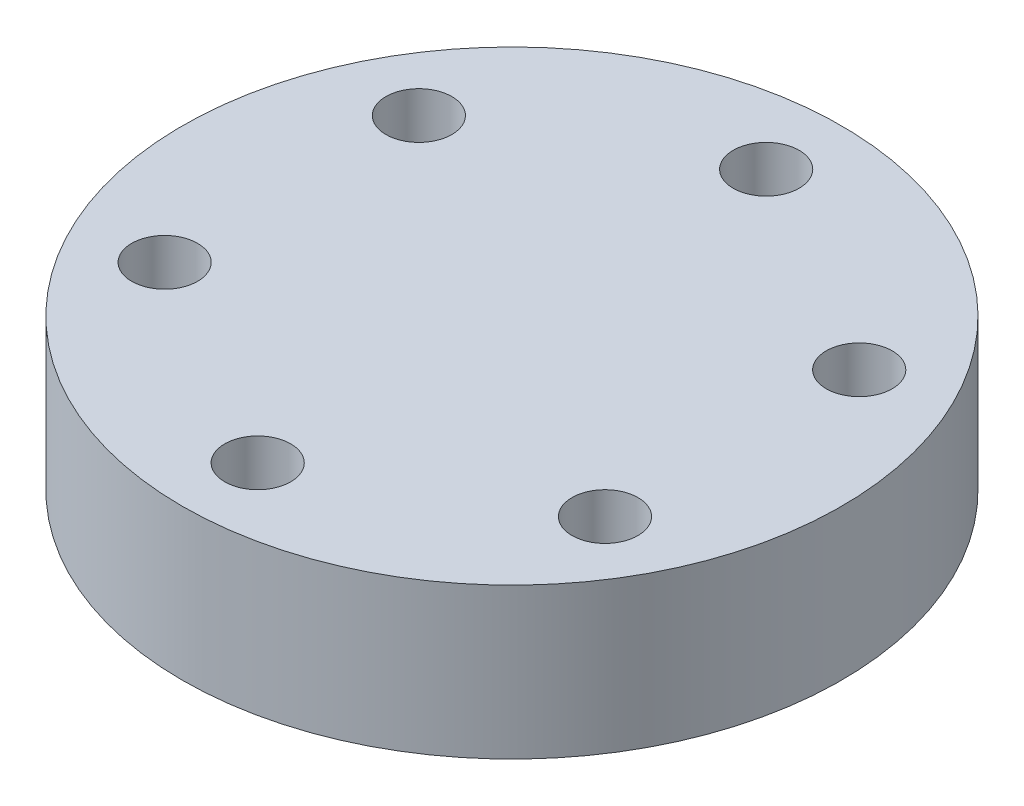
ISO-10303-21;
HEADER;
FILE_DESCRIPTION(('STEP AP214'),'2;1');
FILE_NAME('part.step','',(''),(''),'','','');
FILE_SCHEMA(('AUTOMOTIVE_DESIGN { 1 0 10303 214 1 1 1 1 }'));
ENDSEC;
DATA;
#1=APPLICATION_CONTEXT('core data for automotive mechanical design processes');
#2=APPLICATION_PROTOCOL_DEFINITION('international standard','automotive_design',2000,#1);
#3=PRODUCT_CONTEXT('',#1,'mechanical');
#4=PRODUCT('Part','Part','',(#3));
#5=PRODUCT_RELATED_PRODUCT_CATEGORY('part','',(#4));
#6=PRODUCT_DEFINITION_FORMATION('','',#4);
#7=PRODUCT_DEFINITION_CONTEXT('part definition',#1,'design');
#8=PRODUCT_DEFINITION('design','',#6,#7);
#9=PRODUCT_DEFINITION_SHAPE('','',#8);
#10=(LENGTH_UNIT() NAMED_UNIT(*) SI_UNIT(.MILLI.,.METRE.));
#11=(NAMED_UNIT(*) PLANE_ANGLE_UNIT() SI_UNIT($,.RADIAN.));
#12=(NAMED_UNIT(*) SI_UNIT($,.STERADIAN.) SOLID_ANGLE_UNIT());
#13=UNCERTAINTY_MEASURE_WITH_UNIT(LENGTH_MEASURE(1.E-05),#10,'distance_accuracy_value','');
#14=(GEOMETRIC_REPRESENTATION_CONTEXT(3) GLOBAL_UNCERTAINTY_ASSIGNED_CONTEXT((#13)) GLOBAL_UNIT_ASSIGNED_CONTEXT((#10,
#11,#12)) REPRESENTATION_CONTEXT('',''));
#15=CARTESIAN_POINT('',(0.,0.,0.));
#16=DIRECTION('',(0.,0.,1.));
#17=DIRECTION('',(1.,0.,0.));
#18=AXIS2_PLACEMENT_3D('',#15,#16,#17);
#19=CARTESIAN_POINT('',(0.,8.,0.));
#20=DIRECTION('',(0.,-1.,0.));
#21=DIRECTION('',(0.,0.,-1.));
#22=AXIS2_PLACEMENT_3D('',#19,#20,#21);
#23=CYLINDRICAL_SURFACE('',#22,17.5);
#24=CARTESIAN_POINT('',(0.,8.,0.));
#25=DIRECTION('',(0.,1.,0.));
#26=DIRECTION('',(0.,0.,1.));
#27=AXIS2_PLACEMENT_3D('',#24,#25,#26);
#28=CIRCLE('',#27,17.5);
#29=CARTESIAN_POINT('',(0.,8.,17.5));
#30=VERTEX_POINT('',#29);
#31=EDGE_CURVE('E10',#30,#30,#28,.T.);
#32=ORIENTED_EDGE('',*,*,#31,.F.);
#33=EDGE_LOOP('',(#32));
#34=FACE_BOUND('',#33,.T.);
#35=CARTESIAN_POINT('',(0.,0.,0.));
#36=DIRECTION('',(0.,1.,0.));
#37=DIRECTION('',(0.,0.,1.));
#38=AXIS2_PLACEMENT_3D('',#35,#36,#37);
#39=CIRCLE('',#38,17.5);
#40=CARTESIAN_POINT('',(0.,0.,17.5));
#41=VERTEX_POINT('',#40);
#42=EDGE_CURVE('E40',#41,#41,#39,.T.);
#43=ORIENTED_EDGE('',*,*,#42,.T.);
#44=EDGE_LOOP('',(#43));
#45=FACE_BOUND('',#44,.T.);
#46=ADVANCED_FACE('F33',(#34,#45),#23,.T.);
#47=CARTESIAN_POINT('',(0.,8.,0.));
#48=DIRECTION('',(0.,1.,0.));
#49=DIRECTION('',(0.,0.,1.));
#50=AXIS2_PLACEMENT_3D('',#47,#48,#49);
#51=PLANE('',#50);
#52=CARTESIAN_POINT('',(0.,8.,-13.5));
#53=DIRECTION('',(0.,1.,0.));
#54=DIRECTION('',(0.,0.,1.));
#55=AXIS2_PLACEMENT_3D('',#52,#53,#54);
#56=CIRCLE('',#55,1.75);
#57=CARTESIAN_POINT('',(0.,8.,-11.75));
#58=VERTEX_POINT('',#57);
#59=EDGE_CURVE('E54',#58,#58,#56,.T.);
#60=ORIENTED_EDGE('',*,*,#59,.F.);
#61=EDGE_LOOP('',(#60));
#62=FACE_BOUND('',#61,.T.);
#63=CARTESIAN_POINT('',(-11.6913429510896,8.,-6.7499999999995));
#64=DIRECTION('',(0.,1.,0.));
#65=DIRECTION('',(0.,0.,1.));
#66=AXIS2_PLACEMENT_3D('',#63,#64,#65);
#67=CIRCLE('',#66,1.75000000000058);
#68=CARTESIAN_POINT('',(-11.6913429510896,8.,-4.99999999999892));
#69=VERTEX_POINT('',#68);
#70=EDGE_CURVE('E131',#69,#69,#67,.T.);
#71=ORIENTED_EDGE('',*,*,#70,.F.);
#72=EDGE_LOOP('',(#71));
#73=FACE_BOUND('',#72,.T.);
#74=CARTESIAN_POINT('',(-11.6913429510891,8.,6.7500000000005));
#75=DIRECTION('',(0.,1.,0.));
#76=DIRECTION('',(0.,0.,1.));
#77=AXIS2_PLACEMENT_3D('',#74,#75,#76);
#78=CIRCLE('',#77,1.75000000000109);
#79=CARTESIAN_POINT('',(-11.6913429510891,8.,8.50000000000159));
#80=VERTEX_POINT('',#79);
#81=EDGE_CURVE('E47',#80,#80,#78,.T.);
#82=ORIENTED_EDGE('',*,*,#81,.F.);
#83=EDGE_LOOP('',(#82));
#84=FACE_BOUND('',#83,.T.);
#85=CARTESIAN_POINT('',(1.14611941239482E-12,8.,13.5));
#86=DIRECTION('',(0.,1.,0.));
#87=DIRECTION('',(0.,0.,1.));
#88=AXIS2_PLACEMENT_3D('',#85,#86,#87);
#89=CIRCLE('',#88,1.75000000000119);
#90=CARTESIAN_POINT('',(1.14611941239482E-12,8.,15.2500000000012));
#91=VERTEX_POINT('',#90);
#92=EDGE_CURVE('E125',#91,#91,#89,.T.);
#93=ORIENTED_EDGE('',*,*,#92,.F.);
#94=EDGE_LOOP('',(#93));
#95=FACE_BOUND('',#94,.T.);
#96=CARTESIAN_POINT('',(11.6913429510908,8.,6.7499999999995));
#97=DIRECTION('',(0.,1.,0.));
#98=DIRECTION('',(0.,0.,1.));
#99=AXIS2_PLACEMENT_3D('',#96,#97,#98);
#100=CIRCLE('',#99,1.75000000000074);
#101=CARTESIAN_POINT('',(11.6913429510908,8.,8.50000000000024));
#102=VERTEX_POINT('',#101);
#103=EDGE_CURVE('E117',#102,#102,#100,.T.);
#104=ORIENTED_EDGE('',*,*,#103,.F.);
#105=EDGE_LOOP('',(#104));
#106=FACE_BOUND('',#105,.T.);
#107=CARTESIAN_POINT('',(11.6913429510902,8.,-6.7500000000005));
#108=DIRECTION('',(0.,1.,0.));
#109=DIRECTION('',(0.,0.,1.));
#110=AXIS2_PLACEMENT_3D('',#107,#108,#109);
#111=CIRCLE('',#110,1.75000000000016);
#112=CARTESIAN_POINT('',(11.6913429510902,8.,-5.00000000000034));
#113=VERTEX_POINT('',#112);
#114=EDGE_CURVE('E124',#113,#113,#111,.T.);
#115=ORIENTED_EDGE('',*,*,#114,.F.);
#116=EDGE_LOOP('',(#115));
#117=FACE_BOUND('',#116,.T.);
#118=ORIENTED_EDGE('',*,*,#31,.T.);
#119=EDGE_LOOP('',(#118));
#120=FACE_BOUND('',#119,.T.);
#121=ADVANCED_FACE('F84',(#62,#73,#84,#95,#106,#117,#120),#51,.T.);
#122=CARTESIAN_POINT('',(0.,0.,0.));
#123=DIRECTION('',(0.,1.,0.));
#124=DIRECTION('',(0.,0.,1.));
#125=AXIS2_PLACEMENT_3D('',#122,#123,#124);
#126=PLANE('',#125);
#127=CARTESIAN_POINT('',(0.,0.,-13.5));
#128=DIRECTION('',(0.,1.,0.));
#129=DIRECTION('',(0.,0.,1.));
#130=AXIS2_PLACEMENT_3D('',#127,#128,#129);
#131=CIRCLE('',#130,1.75);
#132=CARTESIAN_POINT('',(0.,0.,-11.75));
#133=VERTEX_POINT('',#132);
#134=EDGE_CURVE('E36',#133,#133,#131,.T.);
#135=ORIENTED_EDGE('',*,*,#134,.T.);
#136=EDGE_LOOP('',(#135));
#137=FACE_BOUND('',#136,.T.);
#138=CARTESIAN_POINT('',(-11.6913429510896,0.,-6.7499999999995));
#139=DIRECTION('',(0.,1.,0.));
#140=DIRECTION('',(0.,0.,1.));
#141=AXIS2_PLACEMENT_3D('',#138,#139,#140);
#142=CIRCLE('',#141,1.75000000000058);
#143=CARTESIAN_POINT('',(-11.6913429510896,0.,-4.99999999999892));
#144=VERTEX_POINT('',#143);
#145=EDGE_CURVE('E62',#144,#144,#142,.T.);
#146=ORIENTED_EDGE('',*,*,#145,.T.);
#147=EDGE_LOOP('',(#146));
#148=FACE_BOUND('',#147,.T.);
#149=CARTESIAN_POINT('',(-11.6913429510891,0.,6.7500000000005));
#150=DIRECTION('',(0.,1.,0.));
#151=DIRECTION('',(0.,0.,1.));
#152=AXIS2_PLACEMENT_3D('',#149,#150,#151);
#153=CIRCLE('',#152,1.75000000000109);
#154=CARTESIAN_POINT('',(-11.6913429510891,0.,8.50000000000159));
#155=VERTEX_POINT('',#154);
#156=EDGE_CURVE('E60',#155,#155,#153,.T.);
#157=ORIENTED_EDGE('',*,*,#156,.T.);
#158=EDGE_LOOP('',(#157));
#159=FACE_BOUND('',#158,.T.);
#160=CARTESIAN_POINT('',(1.14611941239482E-12,0.,13.5));
#161=DIRECTION('',(0.,1.,0.));
#162=DIRECTION('',(0.,0.,1.));
#163=AXIS2_PLACEMENT_3D('',#160,#161,#162);
#164=CIRCLE('',#163,1.75000000000119);
#165=CARTESIAN_POINT('',(1.14611941239482E-12,0.,15.2500000000012));
#166=VERTEX_POINT('',#165);
#167=EDGE_CURVE('E57',#166,#166,#164,.T.);
#168=ORIENTED_EDGE('',*,*,#167,.T.);
#169=EDGE_LOOP('',(#168));
#170=FACE_BOUND('',#169,.T.);
#171=CARTESIAN_POINT('',(11.6913429510908,0.,6.7499999999995));
#172=DIRECTION('',(0.,1.,0.));
#173=DIRECTION('',(0.,0.,1.));
#174=AXIS2_PLACEMENT_3D('',#171,#172,#173);
#175=CIRCLE('',#174,1.75000000000074);
#176=CARTESIAN_POINT('',(11.6913429510908,0.,8.50000000000024));
#177=VERTEX_POINT('',#176);
#178=EDGE_CURVE('E53',#177,#177,#175,.T.);
#179=ORIENTED_EDGE('',*,*,#178,.T.);
#180=EDGE_LOOP('',(#179));
#181=FACE_BOUND('',#180,.T.);
#182=CARTESIAN_POINT('',(11.6913429510902,0.,-6.7500000000005));
#183=DIRECTION('',(0.,1.,0.));
#184=DIRECTION('',(0.,0.,1.));
#185=AXIS2_PLACEMENT_3D('',#182,#183,#184);
#186=CIRCLE('',#185,1.75000000000016);
#187=CARTESIAN_POINT('',(11.6913429510902,0.,-5.00000000000034));
#188=VERTEX_POINT('',#187);
#189=EDGE_CURVE('E50',#188,#188,#186,.T.);
#190=ORIENTED_EDGE('',*,*,#189,.T.);
#191=EDGE_LOOP('',(#190));
#192=FACE_BOUND('',#191,.T.);
#193=ORIENTED_EDGE('',*,*,#42,.F.);
#194=EDGE_LOOP('',(#193));
#195=FACE_BOUND('',#194,.T.);
#196=ADVANCED_FACE('F69',(#137,#148,#159,#170,#181,#192,#195),#126,.F.);
#197=CARTESIAN_POINT('',(11.6913429510902,-6.,-6.7500000000005));
#198=DIRECTION('',(0.,1.,0.));
#199=DIRECTION('',(0.,0.,1.));
#200=AXIS2_PLACEMENT_3D('',#197,#198,#199);
#201=CYLINDRICAL_SURFACE('',#200,1.75000000000016);
#202=ORIENTED_EDGE('',*,*,#114,.T.);
#203=EDGE_LOOP('',(#202));
#204=FACE_BOUND('',#203,.T.);
#205=ORIENTED_EDGE('',*,*,#189,.F.);
#206=EDGE_LOOP('',(#205));
#207=FACE_BOUND('',#206,.T.);
#208=ADVANCED_FACE('F95',(#204,#207),#201,.F.);
#209=CARTESIAN_POINT('',(11.6913429510908,-6.,6.7499999999995));
#210=DIRECTION('',(0.,1.,0.));
#211=DIRECTION('',(0.,0.,1.));
#212=AXIS2_PLACEMENT_3D('',#209,#210,#211);
#213=CYLINDRICAL_SURFACE('',#212,1.75000000000074);
#214=ORIENTED_EDGE('',*,*,#103,.T.);
#215=EDGE_LOOP('',(#214));
#216=FACE_BOUND('',#215,.T.);
#217=ORIENTED_EDGE('',*,*,#178,.F.);
#218=EDGE_LOOP('',(#217));
#219=FACE_BOUND('',#218,.T.);
#220=ADVANCED_FACE('F99',(#216,#219),#213,.F.);
#221=CARTESIAN_POINT('',(1.14611941239482E-12,-6.,13.5));
#222=DIRECTION('',(0.,1.,0.));
#223=DIRECTION('',(0.,0.,1.));
#224=AXIS2_PLACEMENT_3D('',#221,#222,#223);
#225=CYLINDRICAL_SURFACE('',#224,1.75000000000119);
#226=ORIENTED_EDGE('',*,*,#92,.T.);
#227=EDGE_LOOP('',(#226));
#228=FACE_BOUND('',#227,.T.);
#229=ORIENTED_EDGE('',*,*,#167,.F.);
#230=EDGE_LOOP('',(#229));
#231=FACE_BOUND('',#230,.T.);
#232=ADVANCED_FACE('F105',(#228,#231),#225,.F.);
#233=CARTESIAN_POINT('',(-11.6913429510891,-6.,6.7500000000005));
#234=DIRECTION('',(0.,1.,0.));
#235=DIRECTION('',(0.,0.,1.));
#236=AXIS2_PLACEMENT_3D('',#233,#234,#235);
#237=CYLINDRICAL_SURFACE('',#236,1.75000000000109);
#238=ORIENTED_EDGE('',*,*,#81,.T.);
#239=EDGE_LOOP('',(#238));
#240=FACE_BOUND('',#239,.T.);
#241=ORIENTED_EDGE('',*,*,#156,.F.);
#242=EDGE_LOOP('',(#241));
#243=FACE_BOUND('',#242,.T.);
#244=ADVANCED_FACE('F79',(#240,#243),#237,.F.);
#245=CARTESIAN_POINT('',(-11.6913429510896,-6.,-6.7499999999995));
#246=DIRECTION('',(0.,1.,0.));
#247=DIRECTION('',(0.,0.,1.));
#248=AXIS2_PLACEMENT_3D('',#245,#246,#247);
#249=CYLINDRICAL_SURFACE('',#248,1.75000000000058);
#250=ORIENTED_EDGE('',*,*,#70,.T.);
#251=EDGE_LOOP('',(#250));
#252=FACE_BOUND('',#251,.T.);
#253=ORIENTED_EDGE('',*,*,#145,.F.);
#254=EDGE_LOOP('',(#253));
#255=FACE_BOUND('',#254,.T.);
#256=ADVANCED_FACE('F73',(#252,#255),#249,.F.);
#257=CARTESIAN_POINT('',(0.,-6.,-13.5));
#258=DIRECTION('',(0.,1.,0.));
#259=DIRECTION('',(0.,0.,1.));
#260=AXIS2_PLACEMENT_3D('',#257,#258,#259);
#261=CYLINDRICAL_SURFACE('',#260,1.75);
#262=ORIENTED_EDGE('',*,*,#59,.T.);
#263=EDGE_LOOP('',(#262));
#264=FACE_BOUND('',#263,.T.);
#265=ORIENTED_EDGE('',*,*,#134,.F.);
#266=EDGE_LOOP('',(#265));
#267=FACE_BOUND('',#266,.T.);
#268=ADVANCED_FACE('F71',(#264,#267),#261,.F.);
#269=CLOSED_SHELL('',(#46,#121,#196,#208,#220,#232,#244,#256,#268));
#270=MANIFOLD_SOLID_BREP('B2',#269);
#271=ADVANCED_BREP_SHAPE_REPRESENTATION('',(#18,#270),#14);
#272=SHAPE_DEFINITION_REPRESENTATION(#9,#271);
ENDSEC;
END-ISO-10303-21;
